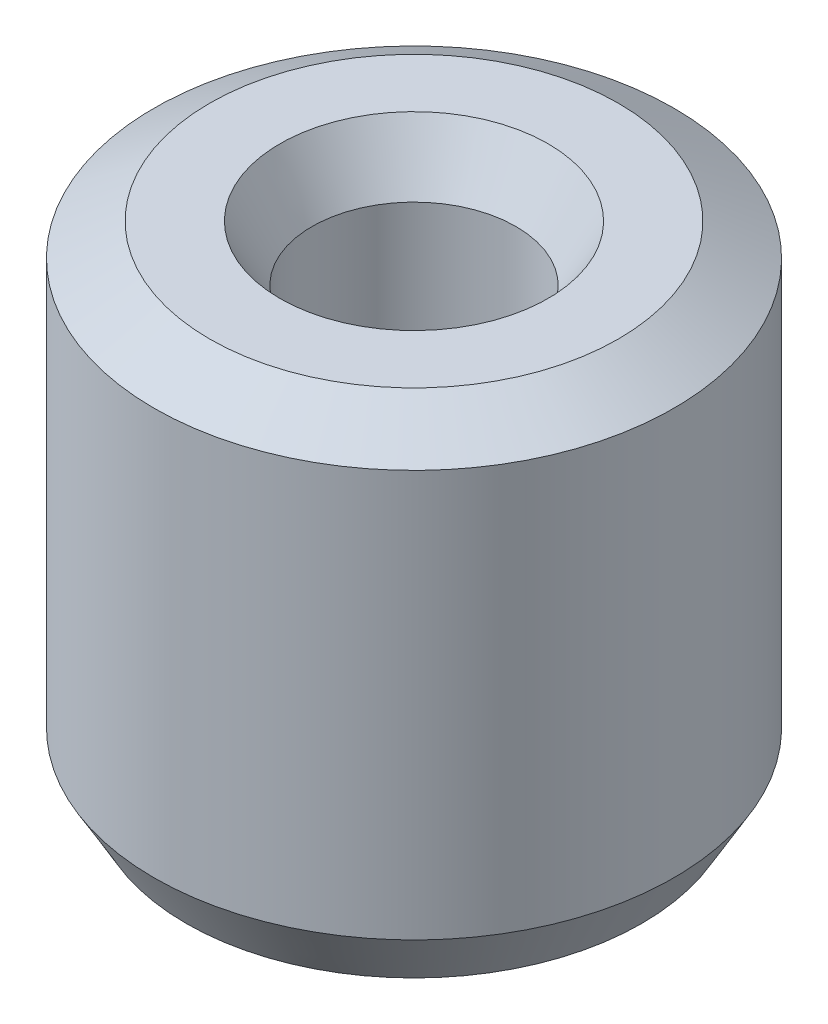
ISO-10303-21;
HEADER;
FILE_DESCRIPTION(('STEP AP214'),'2;1');
FILE_NAME('part.step','',(''),(''),'','','');
FILE_SCHEMA(('AUTOMOTIVE_DESIGN { 1 0 10303 214 1 1 1 1 }'));
ENDSEC;
DATA;
#1=APPLICATION_CONTEXT('core data for automotive mechanical design processes');
#2=APPLICATION_PROTOCOL_DEFINITION('international standard','automotive_design',2000,#1);
#3=PRODUCT_CONTEXT('',#1,'mechanical');
#4=PRODUCT('Part','Part','',(#3));
#5=PRODUCT_RELATED_PRODUCT_CATEGORY('part','',(#4));
#6=PRODUCT_DEFINITION_FORMATION('','',#4);
#7=PRODUCT_DEFINITION_CONTEXT('part definition',#1,'design');
#8=PRODUCT_DEFINITION('design','',#6,#7);
#9=PRODUCT_DEFINITION_SHAPE('','',#8);
#10=(LENGTH_UNIT() NAMED_UNIT(*) SI_UNIT(.MILLI.,.METRE.));
#11=(NAMED_UNIT(*) PLANE_ANGLE_UNIT() SI_UNIT($,.RADIAN.));
#12=(NAMED_UNIT(*) SI_UNIT($,.STERADIAN.) SOLID_ANGLE_UNIT());
#13=UNCERTAINTY_MEASURE_WITH_UNIT(LENGTH_MEASURE(1.E-05),#10,'distance_accuracy_value','');
#14=(GEOMETRIC_REPRESENTATION_CONTEXT(3) GLOBAL_UNCERTAINTY_ASSIGNED_CONTEXT((#13)) GLOBAL_UNIT_ASSIGNED_CONTEXT((#10,
#11,#12)) REPRESENTATION_CONTEXT('',''));
#15=CARTESIAN_POINT('',(0.,0.,0.));
#16=DIRECTION('',(0.,0.,1.));
#17=DIRECTION('',(1.,0.,0.));
#18=AXIS2_PLACEMENT_3D('',#15,#16,#17);
#19=CARTESIAN_POINT('',(0.,23.7763504545418,0.));
#20=DIRECTION('',(0.,-1.,0.));
#21=DIRECTION('',(0.,0.,-1.));
#22=AXIS2_PLACEMENT_3D('',#19,#20,#21);
#23=CYLINDRICAL_SURFACE('',#22,12.5);
#24=CARTESIAN_POINT('',(0.,2.67486488514393,0.));
#25=DIRECTION('',(0.,1.,0.));
#26=DIRECTION('',(0.,0.,1.));
#27=AXIS2_PLACEMENT_3D('',#24,#25,#26);
#28=CIRCLE('',#27,12.5);
#29=CARTESIAN_POINT('',(0.,2.67486488514393,12.5));
#30=VERTEX_POINT('',#29);
#31=EDGE_CURVE('E10',#30,#30,#28,.T.);
#32=ORIENTED_EDGE('',*,*,#31,.T.);
#33=EDGE_LOOP('',(#32));
#34=FACE_BOUND('',#33,.T.);
#35=CARTESIAN_POINT('',(0.,22.2320164930581,0.));
#36=DIRECTION('',(0.,1.,0.));
#37=DIRECTION('',(0.,0.,1.));
#38=AXIS2_PLACEMENT_3D('',#35,#36,#37);
#39=CIRCLE('',#38,12.5);
#40=CARTESIAN_POINT('',(0.,22.2320164930581,12.5));
#41=VERTEX_POINT('',#40);
#42=EDGE_CURVE('E50',#41,#41,#39,.F.);
#43=ORIENTED_EDGE('',*,*,#42,.T.);
#44=EDGE_LOOP('',(#43));
#45=FACE_BOUND('',#44,.T.);
#46=ADVANCED_FACE('F39',(#34,#45),#23,.T.);
#47=CARTESIAN_POINT('',(0.,23.7763504545418,0.));
#48=DIRECTION('',(0.,1.,0.));
#49=DIRECTION('',(0.,0.,1.));
#50=AXIS2_PLACEMENT_3D('',#47,#48,#49);
#51=PLANE('',#50);
#52=CARTESIAN_POINT('',(0.,23.7763504545418,0.));
#53=DIRECTION('',(0.,1.,0.));
#54=DIRECTION('',(0.,0.,1.));
#55=AXIS2_PLACEMENT_3D('',#52,#53,#54);
#56=CIRCLE('',#55,6.4480785698302);
#57=CARTESIAN_POINT('',(0.,23.7763504545418,6.4480785698302));
#58=VERTEX_POINT('',#57);
#59=EDGE_CURVE('E58',#58,#58,#56,.F.);
#60=ORIENTED_EDGE('',*,*,#59,.T.);
#61=EDGE_LOOP('',(#60));
#62=FACE_BOUND('',#61,.T.);
#63=CARTESIAN_POINT('',(0.,23.7763504545418,0.));
#64=DIRECTION('',(0.,1.,0.));
#65=DIRECTION('',(0.,0.,1.));
#66=AXIS2_PLACEMENT_3D('',#63,#64,#65);
#67=CIRCLE('',#66,9.82513511485607);
#68=CARTESIAN_POINT('',(0.,23.7763504545418,9.82513511485607));
#69=VERTEX_POINT('',#68);
#70=EDGE_CURVE('E61',#69,#69,#67,.T.);
#71=ORIENTED_EDGE('',*,*,#70,.T.);
#72=EDGE_LOOP('',(#71));
#73=FACE_BOUND('',#72,.T.);
#74=ADVANCED_FACE('F88',(#62,#73),#51,.T.);
#75=CARTESIAN_POINT('',(0.,0.,0.));
#76=DIRECTION('',(0.,1.,0.));
#77=DIRECTION('',(0.,0.,1.));
#78=AXIS2_PLACEMENT_3D('',#75,#76,#77);
#79=PLANE('',#78);
#80=CARTESIAN_POINT('',(0.,0.,0.));
#81=DIRECTION('',(0.,1.,0.));
#82=DIRECTION('',(0.,0.,1.));
#83=AXIS2_PLACEMENT_3D('',#80,#81,#82);
#84=CIRCLE('',#83,7.57860949349041);
#85=CARTESIAN_POINT('',(0.,0.,-7.57860949349041));
#86=VERTEX_POINT('',#85);
#87=EDGE_CURVE('E51',#86,#86,#84,.T.);
#88=ORIENTED_EDGE('',*,*,#87,.T.);
#89=EDGE_LOOP('',(#88));
#90=FACE_BOUND('',#89,.T.);
#91=CARTESIAN_POINT('',(0.,0.,0.));
#92=DIRECTION('',(0.,1.,0.));
#93=DIRECTION('',(0.,0.,1.));
#94=AXIS2_PLACEMENT_3D('',#91,#92,#93);
#95=CIRCLE('',#94,10.9556660385163);
#96=CARTESIAN_POINT('',(0.,0.,10.9556660385163));
#97=VERTEX_POINT('',#96);
#98=EDGE_CURVE('E54',#97,#97,#95,.F.);
#99=ORIENTED_EDGE('',*,*,#98,.T.);
#100=EDGE_LOOP('',(#99));
#101=FACE_BOUND('',#100,.T.);
#102=ADVANCED_FACE('F83',(#90,#101),#79,.F.);
#103=CARTESIAN_POINT('',(0.,23.7763504545418,0.));
#104=DIRECTION('',(0.,-1.,0.));
#105=DIRECTION('',(0.,0.,-1.));
#106=AXIS2_PLACEMENT_3D('',#103,#104,#105);
#107=CYLINDRICAL_SURFACE('',#106,4.90374460834647);
#108=CARTESIAN_POINT('',(0.,21.1014855693979,0.));
#109=DIRECTION('',(0.,1.,0.));
#110=DIRECTION('',(0.,0.,1.));
#111=AXIS2_PLACEMENT_3D('',#108,#109,#110);
#112=CIRCLE('',#111,4.90374460834647);
#113=CARTESIAN_POINT('',(0.,21.1014855693979,4.90374460834647));
#114=VERTEX_POINT('',#113);
#115=EDGE_CURVE('E67',#114,#114,#112,.T.);
#116=ORIENTED_EDGE('',*,*,#115,.T.);
#117=EDGE_LOOP('',(#116));
#118=FACE_BOUND('',#117,.T.);
#119=CARTESIAN_POINT('',(0.,1.54433396148374,0.));
#120=DIRECTION('',(0.,1.,0.));
#121=DIRECTION('',(0.,0.,1.));
#122=AXIS2_PLACEMENT_3D('',#119,#120,#121);
#123=CIRCLE('',#122,4.90374460834647);
#124=CARTESIAN_POINT('',(0.,1.54433396148374,-4.90374460834647));
#125=VERTEX_POINT('',#124);
#126=EDGE_CURVE('E69',#125,#125,#123,.F.);
#127=ORIENTED_EDGE('',*,*,#126,.T.);
#128=EDGE_LOOP('',(#127));
#129=FACE_BOUND('',#128,.T.);
#130=ADVANCED_FACE('F71',(#118,#129),#107,.F.);
#131=CARTESIAN_POINT('',(0.,21.1014855693979,0.));
#132=DIRECTION('',(0.,1.,0.));
#133=DIRECTION('',(0.,0.,1.));
#134=AXIS2_PLACEMENT_3D('',#131,#132,#133);
#135=CONICAL_SURFACE('',#134,4.90374460834647,0.523598775598303);
#136=ORIENTED_EDGE('',*,*,#59,.F.);
#137=EDGE_LOOP('',(#136));
#138=FACE_BOUND('',#137,.T.);
#139=ORIENTED_EDGE('',*,*,#115,.F.);
#140=EDGE_LOOP('',(#139));
#141=FACE_BOUND('',#140,.T.);
#142=ADVANCED_FACE('F77',(#138,#141),#135,.F.);
#143=CARTESIAN_POINT('',(0.,0.,0.));
#144=DIRECTION('',(0.,-1.,0.));
#145=DIRECTION('',(0.,0.,-1.));
#146=AXIS2_PLACEMENT_3D('',#143,#144,#145);
#147=CONICAL_SURFACE('',#146,7.57860949349041,1.04719755119659);
#148=CARTESIAN_POINT('',(0.,1.54433396148374,-4.90374460834647));
#149=CARTESIAN_POINT('',(0.,1.52824714938495,-4.93160778423339));
#150=CARTESIAN_POINT('',(0.,1.51216033728616,-4.9594709601203));
#151=CARTESIAN_POINT('',(0.,1.47998671308859,-5.01519731189413));
#152=CARTESIAN_POINT('',(0.,1.4638999009898,-5.04306048778105));
#153=CARTESIAN_POINT('',(0.,1.43172627679222,-5.09878683955488));
#154=CARTESIAN_POINT('',(0.,1.41563946469343,-5.1266500154418));
#155=CARTESIAN_POINT('',(0.,1.38346584049585,-5.18237636721563));
#156=CARTESIAN_POINT('',(0.,1.36737902839706,-5.21023954310255));
#157=CARTESIAN_POINT('',(0.,1.33520540419948,-5.26596589487638));
#158=CARTESIAN_POINT('',(0.,1.3191185921007,-5.29382907076329));
#159=CARTESIAN_POINT('',(0.,1.28694496790312,-5.34955542253713));
#160=CARTESIAN_POINT('',(0.,1.27085815580433,-5.37741859842404));
#161=CARTESIAN_POINT('',(0.,1.23868453160675,-5.43314495019788));
#162=CARTESIAN_POINT('',(0.,1.22259771950796,-5.46100812608479));
#163=CARTESIAN_POINT('',(0.,1.19042409531038,-5.51673447785862));
#164=CARTESIAN_POINT('',(0.,1.1743372832116,-5.54459765374554));
#165=CARTESIAN_POINT('',(0.,1.14216365901402,-5.60032400551937));
#166=CARTESIAN_POINT('',(0.,1.12607684691523,-5.62818718140629));
#167=CARTESIAN_POINT('',(0.,1.09390322271765,-5.68391353318012));
#168=CARTESIAN_POINT('',(0.,1.07781641061886,-5.71177670906703));
#169=CARTESIAN_POINT('',(0.,1.04564278642128,-5.76750306084087));
#170=CARTESIAN_POINT('',(0.,1.02955597432249,-5.79536623672778));
#171=CARTESIAN_POINT('',(0.,0.997382350124916,-5.85109258850161));
#172=CARTESIAN_POINT('',(0.,0.981295538026127,-5.87895576438853));
#173=CARTESIAN_POINT('',(0.,0.94912191382855,-5.93468211616236));
#174=CARTESIAN_POINT('',(0.,0.933035101729761,-5.96254529204928));
#175=CARTESIAN_POINT('',(0.,0.900861477532182,-6.01827164382311));
#176=CARTESIAN_POINT('',(0.,0.884774665433394,-6.04613481971003));
#177=CARTESIAN_POINT('',(0.,0.852601041235816,-6.10186117148386));
#178=CARTESIAN_POINT('',(0.,0.836514229137027,-6.12972434737078));
#179=CARTESIAN_POINT('',(0.,0.804340604939449,-6.18545069914461));
#180=CARTESIAN_POINT('',(0.,0.78825379284066,-6.21331387503152));
#181=CARTESIAN_POINT('',(0.,0.756080168643082,-6.26904022680536));
#182=CARTESIAN_POINT('',(0.,0.739993356544293,-6.29690340269227));
#183=CARTESIAN_POINT('',(0.,0.707819732346715,-6.3526297544661));
#184=CARTESIAN_POINT('',(0.,0.691732920247926,-6.38049293035302));
#185=CARTESIAN_POINT('',(0.,0.659559296050348,-6.43621928212685));
#186=CARTESIAN_POINT('',(0.,0.643472483951559,-6.46408245801377));
#187=CARTESIAN_POINT('',(0.,0.611298859753981,-6.5198088097876));
#188=CARTESIAN_POINT('',(0.,0.595212047655192,-6.54767198567452));
#189=CARTESIAN_POINT('',(0.,0.563038423457614,-6.60339833744835));
#190=CARTESIAN_POINT('',(0.,0.546951611358825,-6.63126151333526));
#191=CARTESIAN_POINT('',(0.,0.514777987161247,-6.6869878651091));
#192=CARTESIAN_POINT('',(0.,0.498691175062458,-6.71485104099601));
#193=CARTESIAN_POINT('',(0.,0.46651755086488,-6.77057739276984));
#194=CARTESIAN_POINT('',(0.,0.450430738766091,-6.79844056865676));
#195=CARTESIAN_POINT('',(0.,0.418257114568513,-6.85416692043059));
#196=CARTESIAN_POINT('',(0.,0.402170302469724,-6.88203009631751));
#197=CARTESIAN_POINT('',(0.,0.369996678272146,-6.93775644809134));
#198=CARTESIAN_POINT('',(0.,0.353909866173357,-6.96561962397826));
#199=CARTESIAN_POINT('',(0.,0.321736241975779,-7.02134597575209));
#200=CARTESIAN_POINT('',(0.,0.305649429876991,-7.049209151639));
#201=CARTESIAN_POINT('',(0.,0.273475805679413,-7.10493550341284));
#202=CARTESIAN_POINT('',(0.,0.257388993580624,-7.13279867929975));
#203=CARTESIAN_POINT('',(0.,0.225215369383046,-7.18852503107358));
#204=CARTESIAN_POINT('',(0.,0.209128557284257,-7.2163882069605));
#205=CARTESIAN_POINT('',(0.,0.176954933086679,-7.27211455873433));
#206=CARTESIAN_POINT('',(0.,0.16086812098789,-7.29997773462125));
#207=CARTESIAN_POINT('',(0.,0.128694496790312,-7.35570408639508));
#208=CARTESIAN_POINT('',(0.,0.112607684691523,-7.383567262282));
#209=CARTESIAN_POINT('',(0.,0.0804340604939448,-7.43929361405583));
#210=CARTESIAN_POINT('',(0.,0.0643472483951559,-7.46715678994274));
#211=CARTESIAN_POINT('',(0.,0.0321736241975781,-7.52288314171658));
#212=CARTESIAN_POINT('',(0.,0.0160868120987891,-7.55074631760349));
#213=CARTESIAN_POINT('',(0.,0.,-7.57860949349041));
#214=B_SPLINE_CURVE_WITH_KNOTS('',3,(#148,#149,#150,#151,#152,#153,#154,#155,#156,#157,#158,
#159,#160,#161,#162,#163,#164,#165,#166,#167,#168,#169,#170,#171,#172,#173,#174,#175,#176,#177,
#178,#179,#180,#181,#182,#183,#184,#185,#186,#187,#188,#189,#190,#191,#192,#193,#194,#195,#196,
#197,#198,#199,#200,#201,#202,#203,#204,#205,#206,#207,#208,#209,#210,#211,#212,#213),
.UNSPECIFIED.,.F.,.F.,(4,2,2,2,2,2,2,2,2,2,2,2,2,2,2,2,2,2,2,2,2,2,2,2,2,2,2,2,2,2,2,2,4),(0.,
0.0965208725927338,0.193041745185467,0.2895626177782,0.386083490370934,0.482604362963666,
0.5791252355564,0.675646108149134,0.772166980741866,0.8686878533346,0.965208725927333,
1.06172959852007,1.1582504711128,1.25477134370553,1.35129221629827,1.447813088891,
1.54433396148373,1.64085483407647,1.7373757066692,1.83389657926193,1.93041745185467,
2.0269383244474,2.12345919704013,2.21998006963287,2.3165009422256,2.41302181481833,
2.50954268741107,2.6060635600038,2.70258443259653,2.79910530518926,2.895626177782,
2.99214705037473,3.08866792296746),.UNSPECIFIED.);
#215=EDGE_CURVE('BSEAM73',#125,#86,#214,.T.);
#216=ORIENTED_EDGE('',*,*,#126,.F.);
#217=ORIENTED_EDGE('',*,*,#87,.F.);
#218=ORIENTED_EDGE('',*,*,#215,.T.);
#219=ORIENTED_EDGE('',*,*,#215,.F.);
#220=EDGE_LOOP('',(#216,#218,#217,#219));
#221=FACE_BOUND('',#220,.T.);
#222=ADVANCED_FACE('F73',(#221),#147,.F.);
#223=CARTESIAN_POINT('',(0.,2.67486488514393,0.));
#224=DIRECTION('',(0.,1.,0.));
#225=DIRECTION('',(0.,0.,1.));
#226=AXIS2_PLACEMENT_3D('',#223,#224,#225);
#227=CONICAL_SURFACE('',#226,12.5,0.523598775598303);
#228=ORIENTED_EDGE('',*,*,#98,.F.);
#229=EDGE_LOOP('',(#228));
#230=FACE_BOUND('',#229,.T.);
#231=ORIENTED_EDGE('',*,*,#31,.F.);
#232=EDGE_LOOP('',(#231));
#233=FACE_BOUND('',#232,.T.);
#234=ADVANCED_FACE('F76',(#230,#233),#227,.T.);
#235=CARTESIAN_POINT('',(0.,23.7763504545418,0.));
#236=DIRECTION('',(0.,-1.,0.));
#237=DIRECTION('',(0.,0.,-1.));
#238=AXIS2_PLACEMENT_3D('',#235,#236,#237);
#239=CONICAL_SURFACE('',#238,9.82513511485607,1.04719755119659);
#240=ORIENTED_EDGE('',*,*,#42,.F.);
#241=EDGE_LOOP('',(#240));
#242=FACE_BOUND('',#241,.T.);
#243=ORIENTED_EDGE('',*,*,#70,.F.);
#244=EDGE_LOOP('',(#243));
#245=FACE_BOUND('',#244,.T.);
#246=ADVANCED_FACE('F45',(#242,#245),#239,.T.);
#247=CLOSED_SHELL('',(#46,#74,#102,#130,#142,#222,#234,#246));
#248=MANIFOLD_SOLID_BREP('B2',#247);
#249=ADVANCED_BREP_SHAPE_REPRESENTATION('',(#18,#248),#14);
#250=SHAPE_DEFINITION_REPRESENTATION(#9,#249);
ENDSEC;
END-ISO-10303-21;
